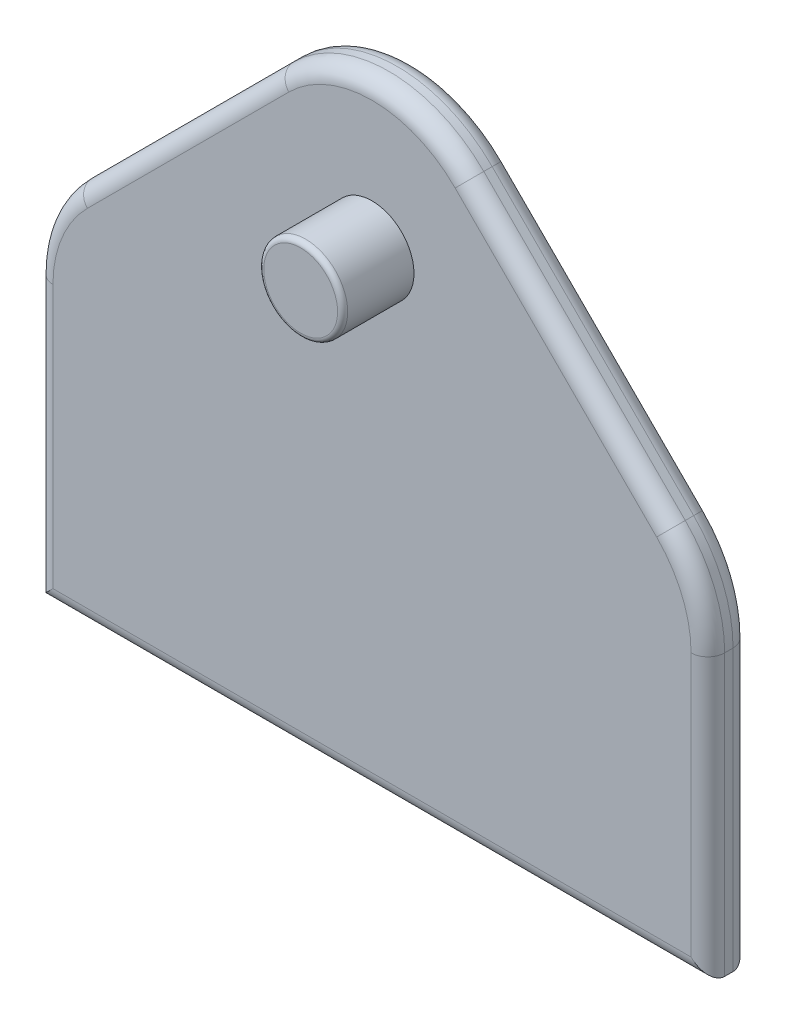
ISO-10303-21;
HEADER;
FILE_DESCRIPTION(('STEP AP214'),'2;1');
FILE_NAME('part.step','',(''),(''),'','','');
FILE_SCHEMA(('AUTOMOTIVE_DESIGN { 1 0 10303 214 1 1 1 1 }'));
ENDSEC;
DATA;
#1=APPLICATION_CONTEXT('core data for automotive mechanical design processes');
#2=APPLICATION_PROTOCOL_DEFINITION('international standard','automotive_design',2000,#1);
#3=PRODUCT_CONTEXT('',#1,'mechanical');
#4=PRODUCT('Part','Part','',(#3));
#5=PRODUCT_RELATED_PRODUCT_CATEGORY('part','',(#4));
#6=PRODUCT_DEFINITION_FORMATION('','',#4);
#7=PRODUCT_DEFINITION_CONTEXT('part definition',#1,'design');
#8=PRODUCT_DEFINITION('design','',#6,#7);
#9=PRODUCT_DEFINITION_SHAPE('','',#8);
#10=(LENGTH_UNIT() NAMED_UNIT(*) SI_UNIT(.MILLI.,.METRE.));
#11=(NAMED_UNIT(*) PLANE_ANGLE_UNIT() SI_UNIT($,.RADIAN.));
#12=(NAMED_UNIT(*) SI_UNIT($,.STERADIAN.) SOLID_ANGLE_UNIT());
#13=UNCERTAINTY_MEASURE_WITH_UNIT(LENGTH_MEASURE(1.E-05),#10,'distance_accuracy_value','');
#14=(GEOMETRIC_REPRESENTATION_CONTEXT(3) GLOBAL_UNCERTAINTY_ASSIGNED_CONTEXT((#13)) GLOBAL_UNIT_ASSIGNED_CONTEXT((#10,
#11,#12)) REPRESENTATION_CONTEXT('',''));
#15=CARTESIAN_POINT('',(0.,0.,0.));
#16=DIRECTION('',(0.,0.,1.));
#17=DIRECTION('',(1.,0.,0.));
#18=AXIS2_PLACEMENT_3D('',#15,#16,#17);
#19=CARTESIAN_POINT('',(0.,0.,0.));
#20=DIRECTION('',(0.,0.,1.));
#21=DIRECTION('',(1.,0.,0.));
#22=AXIS2_PLACEMENT_3D('',#19,#20,#21);
#23=PLANE('',#22);
#24=CARTESIAN_POINT('',(30.48,42.3831804125787,0.));
#25=DIRECTION('',(0.,0.,1.));
#26=DIRECTION('',(1.,0.,0.));
#27=AXIS2_PLACEMENT_3D('',#24,#25,#26);
#28=CIRCLE('',#27,17.78);
#29=CARTESIAN_POINT('',(48.26,42.3831804125787,0.));
#30=VERTEX_POINT('',#29);
#31=CARTESIAN_POINT('',(43.0523585694968,54.9555389820755,0.));
#32=VERTEX_POINT('',#31);
#33=EDGE_CURVE('E332',#30,#32,#28,.T.);
#34=ORIENTED_EDGE('',*,*,#33,.F.);
#35=DIRECTION('',(0.,1.,0.));
#36=VECTOR('',#35,1.);
#37=CARTESIAN_POINT('',(48.26,0.,0.));
#38=LINE('',#37,#36);
#39=CARTESIAN_POINT('',(48.26,2.54,0.));
#40=VERTEX_POINT('',#39);
#41=EDGE_CURVE('E286',#30,#40,#38,.F.);
#42=ORIENTED_EDGE('',*,*,#41,.T.);
#43=DIRECTION('',(1.,0.,0.));
#44=VECTOR('',#43,1.);
#45=CARTESIAN_POINT('',(0.,2.54,0.));
#46=LINE('',#45,#44);
#47=CARTESIAN_POINT('',(-48.26,2.54,0.));
#48=VERTEX_POINT('',#47);
#49=EDGE_CURVE('E289',#40,#48,#46,.F.);
#50=ORIENTED_EDGE('',*,*,#49,.T.);
#51=DIRECTION('',(0.,-1.,0.));
#52=VECTOR('',#51,1.);
#53=CARTESIAN_POINT('',(-48.26,0.,0.));
#54=LINE('',#53,#52);
#55=CARTESIAN_POINT('',(-48.26,42.3831804125787,0.));
#56=VERTEX_POINT('',#55);
#57=EDGE_CURVE('E292',#48,#56,#54,.F.);
#58=ORIENTED_EDGE('',*,*,#57,.T.);
#59=CARTESIAN_POINT('',(-30.48,42.3831804125787,0.));
#60=DIRECTION('',(0.,0.,1.));
#61=DIRECTION('',(1.,0.,0.));
#62=AXIS2_PLACEMENT_3D('',#59,#60,#61);
#63=CIRCLE('',#62,17.78);
#64=CARTESIAN_POINT('',(-43.0523585694968,54.9555389820755,0.));
#65=VERTEX_POINT('',#64);
#66=EDGE_CURVE('E324',#65,#56,#63,.T.);
#67=ORIENTED_EDGE('',*,*,#66,.F.);
#68=DIRECTION('',(-0.707106781186548,-0.707106781186547,0.));
#69=VECTOR('',#68,1.);
#70=CARTESIAN_POINT('',(-49.0039487757862,49.0039487757862,0.));
#71=LINE('',#70,#69);
#72=CARTESIAN_POINT('',(-12.5723585694968,85.4355389820755,0.));
#73=VERTEX_POINT('',#72);
#74=EDGE_CURVE('E278',#65,#73,#71,.F.);
#75=ORIENTED_EDGE('',*,*,#74,.T.);
#76=CARTESIAN_POINT('',(0.,72.8631804125787,0.));
#77=DIRECTION('',(0.,0.,1.));
#78=DIRECTION('',(1.,0.,0.));
#79=AXIS2_PLACEMENT_3D('',#76,#77,#78);
#80=CIRCLE('',#79,17.78);
#81=CARTESIAN_POINT('',(12.5723585694968,85.4355389820755,0.));
#82=VERTEX_POINT('',#81);
#83=EDGE_CURVE('E328',#82,#73,#80,.T.);
#84=ORIENTED_EDGE('',*,*,#83,.F.);
#85=DIRECTION('',(-0.707106781186548,0.707106781186547,0.));
#86=VECTOR('',#85,1.);
#87=CARTESIAN_POINT('',(49.0039487757862,49.0039487757862,0.));
#88=LINE('',#87,#86);
#89=EDGE_CURVE('E282',#82,#32,#88,.F.);
#90=ORIENTED_EDGE('',*,*,#89,.T.);
#91=EDGE_LOOP('',(#34,#42,#50,#58,#67,#75,#84,#90));
#92=FACE_BOUND('',#91,.T.);
#93=CARTESIAN_POINT('',(0.,71.12,0.));
#94=DIRECTION('',(0.,0.,1.));
#95=DIRECTION('',(1.,0.,0.));
#96=AXIS2_PLACEMENT_3D('',#93,#94,#95);
#97=CIRCLE('',#96,6.34999999999999);
#98=CARTESIAN_POINT('',(6.34999999999998,71.12,0.));
#99=VERTEX_POINT('',#98);
#100=EDGE_CURVE('E391',#99,#99,#97,.F.);
#101=ORIENTED_EDGE('',*,*,#100,.F.);
#102=EDGE_LOOP('',(#101));
#103=FACE_BOUND('',#102,.T.);
#104=CARTESIAN_POINT('',(0.,12.7,0.));
#105=DIRECTION('',(0.,0.,-1.));
#106=DIRECTION('',(1.,0.,0.));
#107=AXIS2_PLACEMENT_3D('',#104,#105,#106);
#108=CIRCLE('',#107,38.1);
#109=CARTESIAN_POINT('',(-38.1,12.7,0.));
#110=VERTEX_POINT('',#109);
#111=CARTESIAN_POINT('',(38.1,12.7,0.));
#112=VERTEX_POINT('',#111);
#113=EDGE_CURVE('E213',#110,#112,#108,.T.);
#114=ORIENTED_EDGE('',*,*,#113,.F.);
#115=DIRECTION('',(-1.,0.,0.));
#116=VECTOR('',#115,1.);
#117=CARTESIAN_POINT('',(38.1,12.7,0.));
#118=LINE('',#117,#116);
#119=EDGE_CURVE('E60',#112,#110,#118,.T.);
#120=ORIENTED_EDGE('',*,*,#119,.F.);
#121=EDGE_LOOP('',(#114,#120));
#122=FACE_BOUND('',#121,.T.);
#123=ADVANCED_FACE('F42',(#92,#103,#122),#23,.F.);
#124=CARTESIAN_POINT('',(0.,0.,6.35));
#125=DIRECTION('',(0.,0.,1.));
#126=DIRECTION('',(1.,0.,0.));
#127=AXIS2_PLACEMENT_3D('',#124,#125,#126);
#128=PLANE('',#127);
#129=CARTESIAN_POINT('',(0.,71.12,6.35));
#130=DIRECTION('',(0.,0.,1.));
#131=DIRECTION('',(1.,0.,0.));
#132=AXIS2_PLACEMENT_3D('',#129,#130,#131);
#133=CIRCLE('',#132,6.34999999999999);
#134=CARTESIAN_POINT('',(6.34999999999998,71.12,6.35));
#135=VERTEX_POINT('',#134);
#136=EDGE_CURVE('E215',#135,#135,#133,.F.);
#137=ORIENTED_EDGE('',*,*,#136,.T.);
#138=EDGE_LOOP('',(#137));
#139=FACE_BOUND('',#138,.T.);
#140=CARTESIAN_POINT('',(30.48,42.3831804125787,6.35));
#141=DIRECTION('',(0.,0.,1.));
#142=DIRECTION('',(1.,0.,0.));
#143=AXIS2_PLACEMENT_3D('',#140,#141,#142);
#144=CIRCLE('',#143,17.78);
#145=CARTESIAN_POINT('',(43.0523585694968,54.9555389820755,6.35));
#146=VERTEX_POINT('',#145);
#147=CARTESIAN_POINT('',(48.26,42.3831804125787,6.35));
#148=VERTEX_POINT('',#147);
#149=EDGE_CURVE('E352',#146,#148,#144,.F.);
#150=ORIENTED_EDGE('',*,*,#149,.F.);
#151=DIRECTION('',(-0.707106781186548,0.707106781186547,0.));
#152=VECTOR('',#151,1.);
#153=CARTESIAN_POINT('',(-1.79605122421385,99.8039487757862,6.35));
#154=LINE('',#153,#152);
#155=CARTESIAN_POINT('',(12.5723585694968,85.4355389820755,6.35));
#156=VERTEX_POINT('',#155);
#157=EDGE_CURVE('E238',#146,#156,#154,.T.);
#158=ORIENTED_EDGE('',*,*,#157,.T.);
#159=CARTESIAN_POINT('',(0.,72.8631804125787,6.35));
#160=DIRECTION('',(0.,0.,1.));
#161=DIRECTION('',(1.,0.,0.));
#162=AXIS2_PLACEMENT_3D('',#159,#160,#161);
#163=CIRCLE('',#162,17.78);
#164=CARTESIAN_POINT('',(-12.5723585694968,85.4355389820755,6.35));
#165=VERTEX_POINT('',#164);
#166=EDGE_CURVE('E348',#165,#156,#163,.F.);
#167=ORIENTED_EDGE('',*,*,#166,.F.);
#168=DIRECTION('',(-0.707106781186548,-0.707106781186547,0.));
#169=VECTOR('',#168,1.);
#170=CARTESIAN_POINT('',(-49.0039487757862,49.0039487757862,6.35));
#171=LINE('',#170,#169);
#172=CARTESIAN_POINT('',(-43.0523585694968,54.9555389820755,6.35));
#173=VERTEX_POINT('',#172);
#174=EDGE_CURVE('E234',#165,#173,#171,.T.);
#175=ORIENTED_EDGE('',*,*,#174,.T.);
#176=CARTESIAN_POINT('',(-30.48,42.3831804125787,6.35));
#177=DIRECTION('',(0.,0.,1.));
#178=DIRECTION('',(1.,0.,0.));
#179=AXIS2_PLACEMENT_3D('',#176,#177,#178);
#180=CIRCLE('',#179,17.78);
#181=CARTESIAN_POINT('',(-48.26,42.3831804125787,6.35));
#182=VERTEX_POINT('',#181);
#183=EDGE_CURVE('E344',#182,#173,#180,.F.);
#184=ORIENTED_EDGE('',*,*,#183,.F.);
#185=DIRECTION('',(0.,-1.,0.));
#186=VECTOR('',#185,1.);
#187=CARTESIAN_POINT('',(-48.26,0.,6.35));
#188=LINE('',#187,#186);
#189=CARTESIAN_POINT('',(-48.26,2.54,6.35));
#190=VERTEX_POINT('',#189);
#191=EDGE_CURVE('E249',#182,#190,#188,.T.);
#192=ORIENTED_EDGE('',*,*,#191,.T.);
#193=DIRECTION('',(1.,0.,0.));
#194=VECTOR('',#193,1.);
#195=CARTESIAN_POINT('',(50.8,2.54,6.35));
#196=LINE('',#195,#194);
#197=CARTESIAN_POINT('',(48.26,2.54,6.35));
#198=VERTEX_POINT('',#197);
#199=EDGE_CURVE('E246',#190,#198,#196,.T.);
#200=ORIENTED_EDGE('',*,*,#199,.T.);
#201=DIRECTION('',(0.,1.,0.));
#202=VECTOR('',#201,1.);
#203=CARTESIAN_POINT('',(48.26,50.8,6.35));
#204=LINE('',#203,#202);
#205=EDGE_CURVE('E242',#198,#148,#204,.T.);
#206=ORIENTED_EDGE('',*,*,#205,.T.);
#207=EDGE_LOOP('',(#150,#158,#167,#175,#184,#192,#200,#206));
#208=FACE_BOUND('',#207,.T.);
#209=ADVANCED_FACE('F441',(#139,#208),#128,.T.);
#210=CARTESIAN_POINT('',(-50.8,50.8,6.35));
#211=DIRECTION('',(1.,0.,0.));
#212=DIRECTION('',(0.,1.,0.));
#213=AXIS2_PLACEMENT_3D('',#210,#211,#212);
#214=PLANE('',#213);
#215=DIRECTION('',(0.,-1.,0.));
#216=VECTOR('',#215,1.);
#217=CARTESIAN_POINT('',(-50.8,50.8,3.81));
#218=LINE('',#217,#216);
#219=CARTESIAN_POINT('',(-50.8,0.,3.81));
#220=VERTEX_POINT('',#219);
#221=CARTESIAN_POINT('',(-50.8,42.3831804125787,3.81));
#222=VERTEX_POINT('',#221);
#223=EDGE_CURVE('E251',#220,#222,#218,.F.);
#224=ORIENTED_EDGE('',*,*,#223,.T.);
#225=DIRECTION('',(0.,0.,-1.));
#226=VECTOR('',#225,1.);
#227=CARTESIAN_POINT('',(-50.8,42.3831804125787,6.35));
#228=LINE('',#227,#226);
#229=CARTESIAN_POINT('',(-50.8,42.3831804125787,2.54));
#230=VERTEX_POINT('',#229);
#231=EDGE_CURVE('E372',#222,#230,#228,.T.);
#232=ORIENTED_EDGE('',*,*,#231,.T.);
#233=DIRECTION('',(0.,-1.,0.));
#234=VECTOR('',#233,1.);
#235=CARTESIAN_POINT('',(-50.8,50.8,2.54));
#236=LINE('',#235,#234);
#237=CARTESIAN_POINT('',(-50.8,0.,2.54));
#238=VERTEX_POINT('',#237);
#239=EDGE_CURVE('E268',#230,#238,#236,.T.);
#240=ORIENTED_EDGE('',*,*,#239,.T.);
#241=DIRECTION('',(0.,0.,-1.));
#242=VECTOR('',#241,1.);
#243=CARTESIAN_POINT('',(-50.8,0.,6.35));
#244=LINE('',#243,#242);
#245=EDGE_CURVE('E229',#220,#238,#244,.T.);
#246=ORIENTED_EDGE('',*,*,#245,.F.);
#247=EDGE_LOOP('',(#224,#232,#240,#246));
#248=FACE_BOUND('',#247,.T.);
#249=ADVANCED_FACE('F447',(#248),#214,.F.);
#250=CARTESIAN_POINT('',(-50.8,0.,6.35));
#251=DIRECTION('',(0.,1.,0.));
#252=DIRECTION('',(0.,0.,1.));
#253=AXIS2_PLACEMENT_3D('',#250,#251,#252);
#254=PLANE('',#253);
#255=ORIENTED_EDGE('',*,*,#245,.T.);
#256=DIRECTION('',(1.,0.,0.));
#257=VECTOR('',#256,1.);
#258=CARTESIAN_POINT('',(-50.8,0.,2.54));
#259=LINE('',#258,#257);
#260=CARTESIAN_POINT('',(50.8,0.,2.54));
#261=VERTEX_POINT('',#260);
#262=EDGE_CURVE('E296',#238,#261,#259,.T.);
#263=ORIENTED_EDGE('',*,*,#262,.T.);
#264=DIRECTION('',(0.,0.,-1.));
#265=VECTOR('',#264,1.);
#266=CARTESIAN_POINT('',(50.8,0.,6.35));
#267=LINE('',#266,#265);
#268=CARTESIAN_POINT('',(50.8,0.,3.81));
#269=VERTEX_POINT('',#268);
#270=EDGE_CURVE('E225',#269,#261,#267,.T.);
#271=ORIENTED_EDGE('',*,*,#270,.F.);
#272=DIRECTION('',(1.,0.,0.));
#273=VECTOR('',#272,1.);
#274=CARTESIAN_POINT('',(-50.8,0.,3.81));
#275=LINE('',#274,#273);
#276=EDGE_CURVE('E254',#269,#220,#275,.F.);
#277=ORIENTED_EDGE('',*,*,#276,.T.);
#278=EDGE_LOOP('',(#255,#263,#271,#277));
#279=FACE_BOUND('',#278,.T.);
#280=ADVANCED_FACE('F465',(#279),#254,.F.);
#281=CARTESIAN_POINT('',(50.8,0.,6.35));
#282=DIRECTION('',(-1.,0.,0.));
#283=DIRECTION('',(0.,0.,1.));
#284=AXIS2_PLACEMENT_3D('',#281,#282,#283);
#285=PLANE('',#284);
#286=DIRECTION('',(0.,1.,0.));
#287=VECTOR('',#286,1.);
#288=CARTESIAN_POINT('',(50.8,0.,2.54));
#289=LINE('',#288,#287);
#290=CARTESIAN_POINT('',(50.8,42.3831804125787,2.54));
#291=VERTEX_POINT('',#290);
#292=EDGE_CURVE('E299',#261,#291,#289,.T.);
#293=ORIENTED_EDGE('',*,*,#292,.T.);
#294=DIRECTION('',(0.,0.,-1.));
#295=VECTOR('',#294,1.);
#296=CARTESIAN_POINT('',(50.8,42.3831804125787,6.35));
#297=LINE('',#296,#295);
#298=CARTESIAN_POINT('',(50.8,42.3831804125787,3.81));
#299=VERTEX_POINT('',#298);
#300=EDGE_CURVE('E386',#291,#299,#297,.F.);
#301=ORIENTED_EDGE('',*,*,#300,.T.);
#302=DIRECTION('',(0.,1.,0.));
#303=VECTOR('',#302,1.);
#304=CARTESIAN_POINT('',(50.8,0.,3.81));
#305=LINE('',#304,#303);
#306=EDGE_CURVE('E257',#299,#269,#305,.F.);
#307=ORIENTED_EDGE('',*,*,#306,.T.);
#308=ORIENTED_EDGE('',*,*,#270,.T.);
#309=EDGE_LOOP('',(#293,#301,#307,#308));
#310=FACE_BOUND('',#309,.T.);
#311=ADVANCED_FACE('F461',(#310),#285,.F.);
#312=CARTESIAN_POINT('',(50.8,50.8,6.35));
#313=DIRECTION('',(-0.707106781186547,-0.707106781186548,0.));
#314=DIRECTION('',(0.707106781186548,-0.707106781186547,0.));
#315=AXIS2_PLACEMENT_3D('',#312,#313,#314);
#316=PLANE('',#315);
#317=DIRECTION('',(-0.707106781186548,0.707106781186547,0.));
#318=VECTOR('',#317,1.);
#319=CARTESIAN_POINT('',(50.8,50.8,2.54));
#320=LINE('',#319,#318);
#321=CARTESIAN_POINT('',(44.8484097937106,56.7515902062894,2.54));
#322=VERTEX_POINT('',#321);
#323=CARTESIAN_POINT('',(14.3684097937106,87.2315902062893,2.54));
#324=VERTEX_POINT('',#323);
#325=EDGE_CURVE('E302',#322,#324,#320,.T.);
#326=ORIENTED_EDGE('',*,*,#325,.T.);
#327=DIRECTION('',(0.,0.,-1.));
#328=VECTOR('',#327,1.);
#329=CARTESIAN_POINT('',(14.3684097937106,87.2315902062893,6.35));
#330=LINE('',#329,#328);
#331=CARTESIAN_POINT('',(14.3684097937106,87.2315902062893,3.81));
#332=VERTEX_POINT('',#331);
#333=EDGE_CURVE('E384',#324,#332,#330,.F.);
#334=ORIENTED_EDGE('',*,*,#333,.T.);
#335=DIRECTION('',(-0.707106781186548,0.707106781186547,0.));
#336=VECTOR('',#335,1.);
#337=CARTESIAN_POINT('',(50.8,50.8,3.81));
#338=LINE('',#337,#336);
#339=CARTESIAN_POINT('',(44.8484097937106,56.7515902062894,3.81));
#340=VERTEX_POINT('',#339);
#341=EDGE_CURVE('E260',#332,#340,#338,.F.);
#342=ORIENTED_EDGE('',*,*,#341,.T.);
#343=DIRECTION('',(0.,0.,-1.));
#344=VECTOR('',#343,1.);
#345=CARTESIAN_POINT('',(44.8484097937106,56.7515902062894,6.35));
#346=LINE('',#345,#344);
#347=EDGE_CURVE('E381',#340,#322,#346,.T.);
#348=ORIENTED_EDGE('',*,*,#347,.T.);
#349=EDGE_LOOP('',(#326,#334,#342,#348));
#350=FACE_BOUND('',#349,.T.);
#351=ADVANCED_FACE('F457',(#350),#316,.F.);
#352=CARTESIAN_POINT('',(0.,101.6,6.35));
#353=DIRECTION('',(0.707106781186547,-0.707106781186548,0.));
#354=DIRECTION('',(0.707106781186548,0.707106781186547,0.));
#355=AXIS2_PLACEMENT_3D('',#352,#353,#354);
#356=PLANE('',#355);
#357=DIRECTION('',(-0.707106781186548,-0.707106781186547,0.));
#358=VECTOR('',#357,1.);
#359=CARTESIAN_POINT('',(0.,101.6,2.54));
#360=LINE('',#359,#358);
#361=CARTESIAN_POINT('',(-14.3684097937107,87.2315902062894,2.54));
#362=VERTEX_POINT('',#361);
#363=CARTESIAN_POINT('',(-44.8484097937107,56.7515902062893,2.54));
#364=VERTEX_POINT('',#363);
#365=EDGE_CURVE('E306',#362,#364,#360,.T.);
#366=ORIENTED_EDGE('',*,*,#365,.T.);
#367=DIRECTION('',(0.,0.,-1.));
#368=VECTOR('',#367,1.);
#369=CARTESIAN_POINT('',(-44.8484097937107,56.7515902062894,6.35));
#370=LINE('',#369,#368);
#371=CARTESIAN_POINT('',(-44.8484097937107,56.7515902062893,3.81));
#372=VERTEX_POINT('',#371);
#373=EDGE_CURVE('E378',#364,#372,#370,.F.);
#374=ORIENTED_EDGE('',*,*,#373,.T.);
#375=DIRECTION('',(-0.707106781186548,-0.707106781186547,0.));
#376=VECTOR('',#375,1.);
#377=CARTESIAN_POINT('',(0.,101.6,3.81));
#378=LINE('',#377,#376);
#379=CARTESIAN_POINT('',(-14.3684097937106,87.2315902062894,3.81));
#380=VERTEX_POINT('',#379);
#381=EDGE_CURVE('E264',#372,#380,#378,.F.);
#382=ORIENTED_EDGE('',*,*,#381,.T.);
#383=DIRECTION('',(0.,0.,-1.));
#384=VECTOR('',#383,1.);
#385=CARTESIAN_POINT('',(-14.3684097937107,87.2315902062894,6.35));
#386=LINE('',#385,#384);
#387=EDGE_CURVE('E375',#380,#362,#386,.T.);
#388=ORIENTED_EDGE('',*,*,#387,.T.);
#389=EDGE_LOOP('',(#366,#374,#382,#388));
#390=FACE_BOUND('',#389,.T.);
#391=ADVANCED_FACE('F453',(#390),#356,.F.);
#392=CARTESIAN_POINT('',(49.0039487757862,49.0039487757862,3.81));
#393=DIRECTION('',(0.707106781186548,-0.707106781186547,0.));
#394=DIRECTION('',(0.707106781186547,0.707106781186548,0.));
#395=AXIS2_PLACEMENT_3D('',#392,#393,#394);
#396=CYLINDRICAL_SURFACE('',#395,2.54);
#397=ORIENTED_EDGE('',*,*,#341,.F.);
#398=CARTESIAN_POINT('',(12.5723585694968,85.4355389820755,3.81));
#399=DIRECTION('',(0.707106781186548,-0.707106781186546,0.));
#400=DIRECTION('',(0.707106781186547,0.707106781186549,0.));
#401=AXIS2_PLACEMENT_3D('',#398,#399,#400);
#402=CIRCLE('',#401,2.54);
#403=EDGE_CURVE('E362',#332,#156,#402,.T.);
#404=ORIENTED_EDGE('',*,*,#403,.T.);
#405=ORIENTED_EDGE('',*,*,#157,.F.);
#406=CARTESIAN_POINT('',(43.0523585694968,54.9555389820755,3.81));
#407=DIRECTION('',(-0.707106781186547,0.707106781186547,0.));
#408=DIRECTION('',(-0.707106781186548,-0.707106781186548,0.));
#409=AXIS2_PLACEMENT_3D('',#406,#407,#408);
#410=CIRCLE('',#409,2.54);
#411=EDGE_CURVE('E359',#146,#340,#410,.T.);
#412=ORIENTED_EDGE('',*,*,#411,.T.);
#413=EDGE_LOOP('',(#397,#404,#405,#412));
#414=FACE_BOUND('',#413,.T.);
#415=ADVANCED_FACE('F456',(#414),#396,.T.);
#416=CARTESIAN_POINT('',(48.26,0.,3.81));
#417=DIRECTION('',(0.,-1.,0.));
#418=DIRECTION('',(0.,0.,-1.));
#419=AXIS2_PLACEMENT_3D('',#416,#417,#418);
#420=CYLINDRICAL_SURFACE('',#419,2.54);
#421=ORIENTED_EDGE('',*,*,#306,.F.);
#422=CARTESIAN_POINT('',(48.26,42.3831804125787,3.81));
#423=DIRECTION('',(0.,-1.,0.));
#424=DIRECTION('',(0.,0.,-1.));
#425=AXIS2_PLACEMENT_3D('',#422,#423,#424);
#426=CIRCLE('',#425,2.54);
#427=EDGE_CURVE('E356',#299,#148,#426,.T.);
#428=ORIENTED_EDGE('',*,*,#427,.T.);
#429=ORIENTED_EDGE('',*,*,#205,.F.);
#430=CARTESIAN_POINT('',(48.26,2.54,3.81));
#431=DIRECTION('',(-0.707106781186547,-0.707106781186547,0.));
#432=DIRECTION('',(0.707106781186547,-0.707106781186547,0.));
#433=AXIS2_PLACEMENT_3D('',#430,#431,#432);
#434=ELLIPSE('',#433,3.59210244842766,2.54);
#435=EDGE_CURVE('E230',#269,#198,#434,.T.);
#436=ORIENTED_EDGE('',*,*,#435,.F.);
#437=EDGE_LOOP('',(#421,#428,#429,#436));
#438=FACE_BOUND('',#437,.T.);
#439=ADVANCED_FACE('F485',(#438),#420,.T.);
#440=CARTESIAN_POINT('',(-49.0039487757862,49.0039487757862,3.81));
#441=DIRECTION('',(0.707106781186548,0.707106781186547,0.));
#442=DIRECTION('',(-0.707106781186547,0.707106781186548,0.));
#443=AXIS2_PLACEMENT_3D('',#440,#441,#442);
#444=CYLINDRICAL_SURFACE('',#443,2.54);
#445=ORIENTED_EDGE('',*,*,#381,.F.);
#446=CARTESIAN_POINT('',(-43.0523585694968,54.9555389820755,3.81));
#447=DIRECTION('',(0.707106781186548,0.707106781186548,0.));
#448=DIRECTION('',(-0.707106781186548,0.707106781186548,0.));
#449=AXIS2_PLACEMENT_3D('',#446,#447,#448);
#450=CIRCLE('',#449,2.54);
#451=EDGE_CURVE('E367',#372,#173,#450,.T.);
#452=ORIENTED_EDGE('',*,*,#451,.T.);
#453=ORIENTED_EDGE('',*,*,#174,.F.);
#454=CARTESIAN_POINT('',(-12.5723585694968,85.4355389820755,3.81));
#455=DIRECTION('',(-0.707106781186549,-0.707106781186546,0.));
#456=DIRECTION('',(0.707106781186546,-0.707106781186549,0.));
#457=AXIS2_PLACEMENT_3D('',#454,#455,#456);
#458=CIRCLE('',#457,2.54);
#459=EDGE_CURVE('E364',#165,#380,#458,.T.);
#460=ORIENTED_EDGE('',*,*,#459,.T.);
#461=EDGE_LOOP('',(#445,#452,#453,#460));
#462=FACE_BOUND('',#461,.T.);
#463=ADVANCED_FACE('F481',(#462),#444,.T.);
#464=CARTESIAN_POINT('',(0.,2.54,3.81));
#465=DIRECTION('',(-1.,0.,0.));
#466=DIRECTION('',(0.,0.,1.));
#467=AXIS2_PLACEMENT_3D('',#464,#465,#466);
#468=CYLINDRICAL_SURFACE('',#467,2.54);
#469=ORIENTED_EDGE('',*,*,#435,.T.);
#470=ORIENTED_EDGE('',*,*,#199,.F.);
#471=CARTESIAN_POINT('',(-48.26,2.54,3.81));
#472=DIRECTION('',(-0.707106781186548,0.707106781186547,0.));
#473=DIRECTION('',(-0.707106781186547,-0.707106781186548,0.));
#474=AXIS2_PLACEMENT_3D('',#471,#472,#473);
#475=ELLIPSE('',#474,3.59210244842766,2.54);
#476=EDGE_CURVE('E269',#220,#190,#475,.T.);
#477=ORIENTED_EDGE('',*,*,#476,.F.);
#478=ORIENTED_EDGE('',*,*,#276,.F.);
#479=EDGE_LOOP('',(#469,#470,#477,#478));
#480=FACE_BOUND('',#479,.T.);
#481=ADVANCED_FACE('F477',(#480),#468,.T.);
#482=CARTESIAN_POINT('',(-48.26,0.,3.81));
#483=DIRECTION('',(0.,1.,0.));
#484=DIRECTION('',(-1.,0.,0.));
#485=AXIS2_PLACEMENT_3D('',#482,#483,#484);
#486=CYLINDRICAL_SURFACE('',#485,2.54);
#487=ORIENTED_EDGE('',*,*,#191,.F.);
#488=CARTESIAN_POINT('',(-48.26,42.3831804125787,3.81));
#489=DIRECTION('',(0.,-1.,0.));
#490=DIRECTION('',(0.,0.,-1.));
#491=AXIS2_PLACEMENT_3D('',#488,#489,#490);
#492=CIRCLE('',#491,2.54);
#493=EDGE_CURVE('E370',#182,#222,#492,.T.);
#494=ORIENTED_EDGE('',*,*,#493,.T.);
#495=ORIENTED_EDGE('',*,*,#223,.F.);
#496=ORIENTED_EDGE('',*,*,#476,.T.);
#497=EDGE_LOOP('',(#487,#494,#495,#496));
#498=FACE_BOUND('',#497,.T.);
#499=ADVANCED_FACE('F473',(#498),#486,.T.);
#500=CARTESIAN_POINT('',(49.0039487757862,49.0039487757862,2.54));
#501=DIRECTION('',(-0.707106781186548,0.707106781186547,0.));
#502=DIRECTION('',(-0.707106781186547,-0.707106781186548,0.));
#503=AXIS2_PLACEMENT_3D('',#500,#501,#502);
#504=CYLINDRICAL_SURFACE('',#503,2.54);
#505=ORIENTED_EDGE('',*,*,#325,.F.);
#506=CARTESIAN_POINT('',(43.0523585694968,54.9555389820755,2.54));
#507=DIRECTION('',(-0.707106781186548,0.707106781186548,0.));
#508=DIRECTION('',(-0.707106781186548,-0.707106781186548,0.));
#509=AXIS2_PLACEMENT_3D('',#506,#507,#508);
#510=CIRCLE('',#509,2.54);
#511=EDGE_CURVE('E320',#322,#32,#510,.T.);
#512=ORIENTED_EDGE('',*,*,#511,.T.);
#513=ORIENTED_EDGE('',*,*,#89,.F.);
#514=CARTESIAN_POINT('',(12.5723585694968,85.4355389820755,2.54));
#515=DIRECTION('',(0.70710678118655,-0.707106781186545,0.));
#516=DIRECTION('',(0.707106781186545,0.70710678118655,0.));
#517=AXIS2_PLACEMENT_3D('',#514,#515,#516);
#518=CIRCLE('',#517,2.54);
#519=EDGE_CURVE('E310',#82,#324,#518,.T.);
#520=ORIENTED_EDGE('',*,*,#519,.T.);
#521=EDGE_LOOP('',(#505,#512,#513,#520));
#522=FACE_BOUND('',#521,.T.);
#523=ADVANCED_FACE('F476',(#522),#504,.T.);
#524=CARTESIAN_POINT('',(48.26,0.,2.54));
#525=DIRECTION('',(0.,1.,0.));
#526=DIRECTION('',(0.,0.,1.));
#527=AXIS2_PLACEMENT_3D('',#524,#525,#526);
#528=CYLINDRICAL_SURFACE('',#527,2.54);
#529=ORIENTED_EDGE('',*,*,#41,.F.);
#530=CARTESIAN_POINT('',(48.26,42.3831804125787,2.54));
#531=DIRECTION('',(0.,-1.,0.));
#532=DIRECTION('',(0.,0.,-1.));
#533=AXIS2_PLACEMENT_3D('',#530,#531,#532);
#534=CIRCLE('',#533,2.54);
#535=EDGE_CURVE('E71',#30,#291,#534,.T.);
#536=ORIENTED_EDGE('',*,*,#535,.T.);
#537=ORIENTED_EDGE('',*,*,#292,.F.);
#538=CARTESIAN_POINT('',(48.26,2.54,2.54));
#539=DIRECTION('',(0.707106781186547,0.707106781186547,0.));
#540=DIRECTION('',(-0.707106781186547,0.707106781186547,0.));
#541=AXIS2_PLACEMENT_3D('',#538,#539,#540);
#542=ELLIPSE('',#541,3.59210244842766,2.54);
#543=EDGE_CURVE('E272',#40,#261,#542,.F.);
#544=ORIENTED_EDGE('',*,*,#543,.F.);
#545=EDGE_LOOP('',(#529,#536,#537,#544));
#546=FACE_BOUND('',#545,.T.);
#547=ADVANCED_FACE('F505',(#546),#528,.T.);
#548=CARTESIAN_POINT('',(1.79605122421382,99.8039487757862,2.54));
#549=DIRECTION('',(-0.707106781186548,-0.707106781186547,0.));
#550=DIRECTION('',(0.707106781186547,-0.707106781186548,0.));
#551=AXIS2_PLACEMENT_3D('',#548,#549,#550);
#552=CYLINDRICAL_SURFACE('',#551,2.54);
#553=ORIENTED_EDGE('',*,*,#365,.F.);
#554=CARTESIAN_POINT('',(-12.5723585694968,85.4355389820755,2.54));
#555=DIRECTION('',(-0.707106781186548,-0.707106781186546,0.));
#556=DIRECTION('',(0.707106781186547,-0.707106781186549,0.));
#557=AXIS2_PLACEMENT_3D('',#554,#555,#556);
#558=CIRCLE('',#557,2.54);
#559=EDGE_CURVE('E338',#362,#73,#558,.T.);
#560=ORIENTED_EDGE('',*,*,#559,.T.);
#561=ORIENTED_EDGE('',*,*,#74,.F.);
#562=CARTESIAN_POINT('',(-43.0523585694968,54.9555389820755,2.54));
#563=DIRECTION('',(0.707106781186547,0.707106781186547,0.));
#564=DIRECTION('',(-0.707106781186548,0.707106781186548,0.));
#565=AXIS2_PLACEMENT_3D('',#562,#563,#564);
#566=CIRCLE('',#565,2.54);
#567=EDGE_CURVE('E335',#65,#364,#566,.T.);
#568=ORIENTED_EDGE('',*,*,#567,.T.);
#569=EDGE_LOOP('',(#553,#560,#561,#568));
#570=FACE_BOUND('',#569,.T.);
#571=ADVANCED_FACE('F501',(#570),#552,.T.);
#572=CARTESIAN_POINT('',(-50.8,2.54,2.54));
#573=DIRECTION('',(1.,0.,0.));
#574=DIRECTION('',(0.,0.,-1.));
#575=AXIS2_PLACEMENT_3D('',#572,#573,#574);
#576=CYLINDRICAL_SURFACE('',#575,2.54);
#577=ORIENTED_EDGE('',*,*,#543,.T.);
#578=ORIENTED_EDGE('',*,*,#262,.F.);
#579=CARTESIAN_POINT('',(-48.26,2.54,2.54));
#580=DIRECTION('',(0.707106781186548,-0.707106781186547,0.));
#581=DIRECTION('',(0.707106781186547,0.707106781186548,0.));
#582=AXIS2_PLACEMENT_3D('',#579,#580,#581);
#583=ELLIPSE('',#582,3.59210244842766,2.54);
#584=EDGE_CURVE('E311',#48,#238,#583,.F.);
#585=ORIENTED_EDGE('',*,*,#584,.F.);
#586=ORIENTED_EDGE('',*,*,#49,.F.);
#587=EDGE_LOOP('',(#577,#578,#585,#586));
#588=FACE_BOUND('',#587,.T.);
#589=ADVANCED_FACE('F497',(#588),#576,.T.);
#590=CARTESIAN_POINT('',(-48.26,50.8,2.54));
#591=DIRECTION('',(0.,-1.,0.));
#592=DIRECTION('',(1.,0.,0.));
#593=AXIS2_PLACEMENT_3D('',#590,#591,#592);
#594=CYLINDRICAL_SURFACE('',#593,2.54);
#595=ORIENTED_EDGE('',*,*,#239,.F.);
#596=CARTESIAN_POINT('',(-48.26,42.3831804125787,2.54));
#597=DIRECTION('',(0.,-1.,0.));
#598=DIRECTION('',(0.,0.,-1.));
#599=AXIS2_PLACEMENT_3D('',#596,#597,#598);
#600=CIRCLE('',#599,2.54);
#601=EDGE_CURVE('E341',#230,#56,#600,.T.);
#602=ORIENTED_EDGE('',*,*,#601,.T.);
#603=ORIENTED_EDGE('',*,*,#57,.F.);
#604=ORIENTED_EDGE('',*,*,#584,.T.);
#605=EDGE_LOOP('',(#595,#602,#603,#604));
#606=FACE_BOUND('',#605,.T.);
#607=ADVANCED_FACE('F493',(#606),#594,.T.);
#608=CARTESIAN_POINT('',(30.48,42.3831804125787,3.81));
#609=DIRECTION('',(0.,0.,1.));
#610=DIRECTION('',(1.,0.,0.));
#611=AXIS2_PLACEMENT_3D('',#608,#609,#610);
#612=TOROIDAL_SURFACE('',#611,17.78,2.54);
#613=ORIENTED_EDGE('',*,*,#149,.T.);
#614=ORIENTED_EDGE('',*,*,#427,.F.);
#615=CARTESIAN_POINT('',(30.48,42.3831804125787,3.81));
#616=DIRECTION('',(0.,0.,1.));
#617=DIRECTION('',(1.,0.,0.));
#618=AXIS2_PLACEMENT_3D('',#615,#616,#617);
#619=CIRCLE('',#618,20.32);
#620=EDGE_CURVE('E315',#340,#299,#619,.F.);
#621=ORIENTED_EDGE('',*,*,#620,.F.);
#622=ORIENTED_EDGE('',*,*,#411,.F.);
#623=EDGE_LOOP('',(#613,#614,#621,#622));
#624=FACE_BOUND('',#623,.T.);
#625=ADVANCED_FACE('F496',(#624),#612,.T.);
#626=CARTESIAN_POINT('',(30.48,42.3831804125787,6.35));
#627=DIRECTION('',(0.,0.,-1.));
#628=DIRECTION('',(-1.,0.,0.));
#629=AXIS2_PLACEMENT_3D('',#626,#627,#628);
#630=CYLINDRICAL_SURFACE('',#629,20.32);
#631=ORIENTED_EDGE('',*,*,#620,.T.);
#632=ORIENTED_EDGE('',*,*,#300,.F.);
#633=CARTESIAN_POINT('',(30.48,42.3831804125787,2.54));
#634=DIRECTION('',(0.,0.,1.));
#635=DIRECTION('',(1.,0.,0.));
#636=AXIS2_PLACEMENT_3D('',#633,#634,#635);
#637=CIRCLE('',#636,20.32);
#638=EDGE_CURVE('E392',#322,#291,#637,.F.);
#639=ORIENTED_EDGE('',*,*,#638,.F.);
#640=ORIENTED_EDGE('',*,*,#347,.F.);
#641=EDGE_LOOP('',(#631,#632,#639,#640));
#642=FACE_BOUND('',#641,.T.);
#643=ADVANCED_FACE('F516',(#642),#630,.T.);
#644=CARTESIAN_POINT('',(30.48,42.3831804125787,2.54));
#645=DIRECTION('',(0.,0.,1.));
#646=DIRECTION('',(1.,0.,0.));
#647=AXIS2_PLACEMENT_3D('',#644,#645,#646);
#648=TOROIDAL_SURFACE('',#647,17.78,2.54);
#649=ORIENTED_EDGE('',*,*,#511,.F.);
#650=ORIENTED_EDGE('',*,*,#638,.T.);
#651=ORIENTED_EDGE('',*,*,#535,.F.);
#652=ORIENTED_EDGE('',*,*,#33,.T.);
#653=EDGE_LOOP('',(#649,#650,#651,#652));
#654=FACE_BOUND('',#653,.T.);
#655=ADVANCED_FACE('F512',(#654),#648,.T.);
#656=CARTESIAN_POINT('',(0.,72.8631804125787,3.81));
#657=DIRECTION('',(0.,0.,1.));
#658=DIRECTION('',(1.,0.,0.));
#659=AXIS2_PLACEMENT_3D('',#656,#657,#658);
#660=TOROIDAL_SURFACE('',#659,17.78,2.54);
#661=ORIENTED_EDGE('',*,*,#166,.T.);
#662=ORIENTED_EDGE('',*,*,#403,.F.);
#663=CARTESIAN_POINT('',(0.,72.8631804125787,3.81));
#664=DIRECTION('',(0.,0.,1.));
#665=DIRECTION('',(1.,0.,0.));
#666=AXIS2_PLACEMENT_3D('',#663,#664,#665);
#667=CIRCLE('',#666,20.32);
#668=EDGE_CURVE('E396',#380,#332,#667,.F.);
#669=ORIENTED_EDGE('',*,*,#668,.F.);
#670=ORIENTED_EDGE('',*,*,#459,.F.);
#671=EDGE_LOOP('',(#661,#662,#669,#670));
#672=FACE_BOUND('',#671,.T.);
#673=ADVANCED_FACE('F515',(#672),#660,.T.);
#674=CARTESIAN_POINT('',(0.,72.8631804125787,6.35));
#675=DIRECTION('',(0.,0.,-1.));
#676=DIRECTION('',(-1.,0.,0.));
#677=AXIS2_PLACEMENT_3D('',#674,#675,#676);
#678=CYLINDRICAL_SURFACE('',#677,20.32);
#679=ORIENTED_EDGE('',*,*,#668,.T.);
#680=ORIENTED_EDGE('',*,*,#333,.F.);
#681=CARTESIAN_POINT('',(0.,72.8631804125787,2.54));
#682=DIRECTION('',(0.,0.,1.));
#683=DIRECTION('',(1.,0.,0.));
#684=AXIS2_PLACEMENT_3D('',#681,#682,#683);
#685=CIRCLE('',#684,20.32);
#686=EDGE_CURVE('E400',#362,#324,#685,.F.);
#687=ORIENTED_EDGE('',*,*,#686,.F.);
#688=ORIENTED_EDGE('',*,*,#387,.F.);
#689=EDGE_LOOP('',(#679,#680,#687,#688));
#690=FACE_BOUND('',#689,.T.);
#691=ADVANCED_FACE('F528',(#690),#678,.T.);
#692=CARTESIAN_POINT('',(0.,72.8631804125787,2.54));
#693=DIRECTION('',(0.,0.,1.));
#694=DIRECTION('',(1.,0.,0.));
#695=AXIS2_PLACEMENT_3D('',#692,#693,#694);
#696=TOROIDAL_SURFACE('',#695,17.78,2.54);
#697=ORIENTED_EDGE('',*,*,#519,.F.);
#698=ORIENTED_EDGE('',*,*,#83,.T.);
#699=ORIENTED_EDGE('',*,*,#559,.F.);
#700=ORIENTED_EDGE('',*,*,#686,.T.);
#701=EDGE_LOOP('',(#697,#698,#699,#700));
#702=FACE_BOUND('',#701,.T.);
#703=ADVANCED_FACE('F524',(#702),#696,.T.);
#704=CARTESIAN_POINT('',(-30.48,42.3831804125787,3.81));
#705=DIRECTION('',(0.,0.,1.));
#706=DIRECTION('',(1.,0.,0.));
#707=AXIS2_PLACEMENT_3D('',#704,#705,#706);
#708=TOROIDAL_SURFACE('',#707,17.78,2.54);
#709=ORIENTED_EDGE('',*,*,#183,.T.);
#710=ORIENTED_EDGE('',*,*,#451,.F.);
#711=CARTESIAN_POINT('',(-30.48,42.3831804125787,3.81));
#712=DIRECTION('',(0.,0.,1.));
#713=DIRECTION('',(1.,0.,0.));
#714=AXIS2_PLACEMENT_3D('',#711,#712,#713);
#715=CIRCLE('',#714,20.32);
#716=EDGE_CURVE('E404',#222,#372,#715,.F.);
#717=ORIENTED_EDGE('',*,*,#716,.F.);
#718=ORIENTED_EDGE('',*,*,#493,.F.);
#719=EDGE_LOOP('',(#709,#710,#717,#718));
#720=FACE_BOUND('',#719,.T.);
#721=ADVANCED_FACE('F527',(#720),#708,.T.);
#722=CARTESIAN_POINT('',(-30.48,42.3831804125787,6.35));
#723=DIRECTION('',(0.,0.,-1.));
#724=DIRECTION('',(-1.,0.,0.));
#725=AXIS2_PLACEMENT_3D('',#722,#723,#724);
#726=CYLINDRICAL_SURFACE('',#725,20.32);
#727=ORIENTED_EDGE('',*,*,#716,.T.);
#728=ORIENTED_EDGE('',*,*,#373,.F.);
#729=CARTESIAN_POINT('',(-30.48,42.3831804125787,2.54));
#730=DIRECTION('',(0.,0.,1.));
#731=DIRECTION('',(1.,0.,0.));
#732=AXIS2_PLACEMENT_3D('',#729,#730,#731);
#733=CIRCLE('',#732,20.32);
#734=EDGE_CURVE('E220',#230,#364,#733,.F.);
#735=ORIENTED_EDGE('',*,*,#734,.F.);
#736=ORIENTED_EDGE('',*,*,#231,.F.);
#737=EDGE_LOOP('',(#727,#728,#735,#736));
#738=FACE_BOUND('',#737,.T.);
#739=ADVANCED_FACE('F540',(#738),#726,.T.);
#740=CARTESIAN_POINT('',(-30.48,42.3831804125787,2.54));
#741=DIRECTION('',(0.,0.,1.));
#742=DIRECTION('',(1.,0.,0.));
#743=AXIS2_PLACEMENT_3D('',#740,#741,#742);
#744=TOROIDAL_SURFACE('',#743,17.78,2.54);
#745=ORIENTED_EDGE('',*,*,#567,.F.);
#746=ORIENTED_EDGE('',*,*,#66,.T.);
#747=ORIENTED_EDGE('',*,*,#601,.F.);
#748=ORIENTED_EDGE('',*,*,#734,.T.);
#749=EDGE_LOOP('',(#745,#746,#747,#748));
#750=FACE_BOUND('',#749,.T.);
#751=ADVANCED_FACE('F536',(#750),#744,.T.);
#752=CARTESIAN_POINT('',(0.,71.12,-4.445));
#753=DIRECTION('',(0.,0.,1.));
#754=DIRECTION('',(1.,0.,0.));
#755=AXIS2_PLACEMENT_3D('',#752,#753,#754);
#756=PLANE('',#755);
#757=CARTESIAN_POINT('',(0.,71.12,-4.445));
#758=DIRECTION('',(0.,0.,1.));
#759=DIRECTION('',(1.,0.,0.));
#760=AXIS2_PLACEMENT_3D('',#757,#758,#759);
#761=CIRCLE('',#760,5.58799999999999);
#762=CARTESIAN_POINT('',(5.58799999999998,71.12,-4.445));
#763=VERTEX_POINT('',#762);
#764=EDGE_CURVE('E421',#763,#763,#761,.F.);
#765=ORIENTED_EDGE('',*,*,#764,.T.);
#766=EDGE_LOOP('',(#765));
#767=FACE_BOUND('',#766,.T.);
#768=ADVANCED_FACE('F539',(#767),#756,.F.);
#769=CARTESIAN_POINT('',(0.,71.12,17.145));
#770=DIRECTION('',(0.,0.,-1.));
#771=DIRECTION('',(-1.,0.,0.));
#772=AXIS2_PLACEMENT_3D('',#769,#770,#771);
#773=CYLINDRICAL_SURFACE('',#772,6.34999999999999);
#774=CARTESIAN_POINT('',(0.,71.12,-3.683));
#775=DIRECTION('',(0.,0.,1.));
#776=DIRECTION('',(1.,0.,0.));
#777=AXIS2_PLACEMENT_3D('',#774,#775,#776);
#778=CIRCLE('',#777,6.34999999999999);
#779=CARTESIAN_POINT('',(6.34999999999998,71.12,-3.683));
#780=VERTEX_POINT('',#779);
#781=EDGE_CURVE('E417',#780,#780,#778,.T.);
#782=ORIENTED_EDGE('',*,*,#781,.T.);
#783=EDGE_LOOP('',(#782));
#784=FACE_BOUND('',#783,.T.);
#785=ORIENTED_EDGE('',*,*,#100,.T.);
#786=EDGE_LOOP('',(#785));
#787=FACE_BOUND('',#786,.T.);
#788=ADVANCED_FACE('F614',(#784,#787),#773,.T.);
#789=CARTESIAN_POINT('',(0.,71.12,16.383));
#790=DIRECTION('',(0.,0.,1.));
#791=DIRECTION('',(1.,0.,0.));
#792=AXIS2_PLACEMENT_3D('',#789,#790,#791);
#793=CIRCLE('',#792,6.34999999999999);
#794=CARTESIAN_POINT('',(6.34999999999998,71.12,16.383));
#795=VERTEX_POINT('',#794);
#796=EDGE_CURVE('E11',#795,#795,#793,.F.);
#797=ORIENTED_EDGE('',*,*,#796,.T.);
#798=EDGE_LOOP('',(#797));
#799=FACE_BOUND('',#798,.T.);
#800=ORIENTED_EDGE('',*,*,#136,.F.);
#801=EDGE_LOOP('',(#800));
#802=FACE_BOUND('',#801,.T.);
#803=ADVANCED_FACE('F622',(#799,#802),#773,.T.);
#804=CARTESIAN_POINT('',(0.,71.12,17.145));
#805=DIRECTION('',(0.,0.,1.));
#806=DIRECTION('',(1.,0.,0.));
#807=AXIS2_PLACEMENT_3D('',#804,#805,#806);
#808=PLANE('',#807);
#809=CARTESIAN_POINT('',(0.,71.12,17.145));
#810=DIRECTION('',(0.,0.,1.));
#811=DIRECTION('',(1.,0.,0.));
#812=AXIS2_PLACEMENT_3D('',#809,#810,#811);
#813=CIRCLE('',#812,5.58799999999999);
#814=CARTESIAN_POINT('',(5.58799999999998,71.12,17.145));
#815=VERTEX_POINT('',#814);
#816=EDGE_CURVE('E51',#815,#815,#813,.T.);
#817=ORIENTED_EDGE('',*,*,#816,.T.);
#818=EDGE_LOOP('',(#817));
#819=FACE_BOUND('',#818,.T.);
#820=ADVANCED_FACE('F428',(#819),#808,.T.);
#821=CARTESIAN_POINT('',(0.,71.12,-3.683));
#822=DIRECTION('',(0.,0.,1.));
#823=DIRECTION('',(1.,0.,0.));
#824=AXIS2_PLACEMENT_3D('',#821,#822,#823);
#825=TOROIDAL_SURFACE('',#824,5.58799999999999,0.762);
#826=ORIENTED_EDGE('',*,*,#764,.F.);
#827=EDGE_LOOP('',(#826));
#828=FACE_BOUND('',#827,.T.);
#829=ORIENTED_EDGE('',*,*,#781,.F.);
#830=EDGE_LOOP('',(#829));
#831=FACE_BOUND('',#830,.T.);
#832=ADVANCED_FACE('F431',(#828,#831),#825,.T.);
#833=CARTESIAN_POINT('',(0.,71.12,16.383));
#834=DIRECTION('',(0.,0.,1.));
#835=DIRECTION('',(1.,0.,0.));
#836=AXIS2_PLACEMENT_3D('',#833,#834,#835);
#837=TOROIDAL_SURFACE('',#836,5.58799999999999,0.762);
#838=ORIENTED_EDGE('',*,*,#796,.F.);
#839=EDGE_LOOP('',(#838));
#840=FACE_BOUND('',#839,.T.);
#841=ORIENTED_EDGE('',*,*,#816,.F.);
#842=EDGE_LOOP('',(#841));
#843=FACE_BOUND('',#842,.T.);
#844=ADVANCED_FACE('F44',(#840,#843),#837,.T.);
#845=CARTESIAN_POINT('',(0.,12.7,-3.81));
#846=DIRECTION('',(0.,0.,1.));
#847=DIRECTION('',(1.,0.,0.));
#848=AXIS2_PLACEMENT_3D('',#845,#846,#847);
#849=CYLINDRICAL_SURFACE('',#848,38.1);
#850=ORIENTED_EDGE('',*,*,#113,.T.);
#851=DIRECTION('',(0.,0.,1.));
#852=VECTOR('',#851,1.);
#853=CARTESIAN_POINT('',(38.1,12.7,-3.81));
#854=LINE('',#853,#852);
#855=CARTESIAN_POINT('',(38.1,12.7,-3.81));
#856=VERTEX_POINT('',#855);
#857=EDGE_CURVE('E199',#856,#112,#854,.T.);
#858=ORIENTED_EDGE('',*,*,#857,.F.);
#859=CARTESIAN_POINT('',(0.,12.7,-3.81));
#860=DIRECTION('',(0.,0.,-1.));
#861=DIRECTION('',(1.,0.,0.));
#862=AXIS2_PLACEMENT_3D('',#859,#860,#861);
#863=CIRCLE('',#862,38.1);
#864=CARTESIAN_POINT('',(-38.1,12.7,-3.81));
#865=VERTEX_POINT('',#864);
#866=EDGE_CURVE('E206',#865,#856,#863,.T.);
#867=ORIENTED_EDGE('',*,*,#866,.F.);
#868=DIRECTION('',(0.,0.,1.));
#869=VECTOR('',#868,1.);
#870=CARTESIAN_POINT('',(-38.1,12.7,-3.81));
#871=LINE('',#870,#869);
#872=EDGE_CURVE('E202',#865,#110,#871,.T.);
#873=ORIENTED_EDGE('',*,*,#872,.T.);
#874=EDGE_LOOP('',(#850,#858,#867,#873));
#875=FACE_BOUND('',#874,.T.);
#876=ADVANCED_FACE('F212',(#875),#849,.T.);
#877=CARTESIAN_POINT('',(38.1,12.7,-3.81));
#878=DIRECTION('',(0.,1.,0.));
#879=DIRECTION('',(0.,0.,1.));
#880=AXIS2_PLACEMENT_3D('',#877,#878,#879);
#881=PLANE('',#880);
#882=ORIENTED_EDGE('',*,*,#119,.T.);
#883=ORIENTED_EDGE('',*,*,#872,.F.);
#884=DIRECTION('',(-1.,0.,0.));
#885=VECTOR('',#884,1.);
#886=CARTESIAN_POINT('',(38.1,12.7,-3.81));
#887=LINE('',#886,#885);
#888=EDGE_CURVE('E195',#856,#865,#887,.T.);
#889=ORIENTED_EDGE('',*,*,#888,.F.);
#890=ORIENTED_EDGE('',*,*,#857,.T.);
#891=EDGE_LOOP('',(#882,#883,#889,#890));
#892=FACE_BOUND('',#891,.T.);
#893=ADVANCED_FACE('F197',(#892),#881,.F.);
#894=CARTESIAN_POINT('',(0.,12.7,-3.81));
#895=DIRECTION('',(0.,0.,1.));
#896=DIRECTION('',(1.,0.,0.));
#897=AXIS2_PLACEMENT_3D('',#894,#895,#896);
#898=PLANE('',#897);
#899=ORIENTED_EDGE('',*,*,#866,.T.);
#900=ORIENTED_EDGE('',*,*,#888,.T.);
#901=EDGE_LOOP('',(#899,#900));
#902=FACE_BOUND('',#901,.T.);
#903=ADVANCED_FACE('F208',(#902),#898,.F.);
#904=CLOSED_SHELL('',(#123,#209,#249,#280,#311,#351,#391,#415,#439,#463,#481,#499,#523,#547,
#571,#589,#607,#625,#643,#655,#673,#691,#703,#721,#739,#751,#768,#788,#803,#820,#832,#844,#876,
#893,#903));
#905=MANIFOLD_SOLID_BREP('B2',#904);
#906=ADVANCED_BREP_SHAPE_REPRESENTATION('',(#18,#905),#14);
#907=SHAPE_DEFINITION_REPRESENTATION(#9,#906);
ENDSEC;
END-ISO-10303-21;
